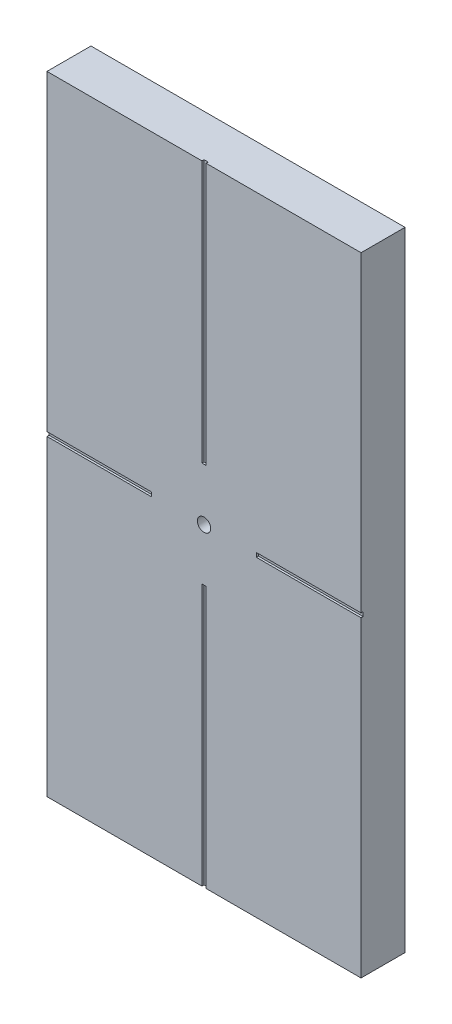
ISO-10303-21;
HEADER;
FILE_DESCRIPTION(('STEP AP214'),'2;1');
FILE_NAME('part.step','',(''),(''),'','','');
FILE_SCHEMA(('AUTOMOTIVE_DESIGN { 1 0 10303 214 1 1 1 1 }'));
ENDSEC;
DATA;
#1=APPLICATION_CONTEXT('core data for automotive mechanical design processes');
#2=APPLICATION_PROTOCOL_DEFINITION('international standard','automotive_design',2000,#1);
#3=PRODUCT_CONTEXT('',#1,'mechanical');
#4=PRODUCT('Part','Part','',(#3));
#5=PRODUCT_RELATED_PRODUCT_CATEGORY('part','',(#4));
#6=PRODUCT_DEFINITION_FORMATION('','',#4);
#7=PRODUCT_DEFINITION_CONTEXT('part definition',#1,'design');
#8=PRODUCT_DEFINITION('design','',#6,#7);
#9=PRODUCT_DEFINITION_SHAPE('','',#8);
#10=(LENGTH_UNIT() NAMED_UNIT(*) SI_UNIT(.MILLI.,.METRE.));
#11=(NAMED_UNIT(*) PLANE_ANGLE_UNIT() SI_UNIT($,.RADIAN.));
#12=(NAMED_UNIT(*) SI_UNIT($,.STERADIAN.) SOLID_ANGLE_UNIT());
#13=UNCERTAINTY_MEASURE_WITH_UNIT(LENGTH_MEASURE(1.E-05),#10,'distance_accuracy_value','');
#14=(GEOMETRIC_REPRESENTATION_CONTEXT(3) GLOBAL_UNCERTAINTY_ASSIGNED_CONTEXT((#13)) GLOBAL_UNIT_ASSIGNED_CONTEXT((#10,
#11,#12)) REPRESENTATION_CONTEXT('',''));
#15=CARTESIAN_POINT('',(0.,0.,0.));
#16=DIRECTION('',(0.,0.,1.));
#17=DIRECTION('',(1.,0.,0.));
#18=AXIS2_PLACEMENT_3D('',#15,#16,#17);
#19=CARTESIAN_POINT('',(0.,0.,8.26141317852243));
#20=DIRECTION('',(0.,0.,-1.));
#21=DIRECTION('',(-1.,0.,0.));
#22=AXIS2_PLACEMENT_3D('',#19,#20,#21);
#23=CYLINDRICAL_SURFACE('',#22,1.5875);
#24=CARTESIAN_POINT('',(0.,0.,-6.325));
#25=DIRECTION('',(0.,0.,-1.));
#26=DIRECTION('',(-1.,0.,0.));
#27=AXIS2_PLACEMENT_3D('',#24,#25,#26);
#28=CIRCLE('',#27,1.5875);
#29=CARTESIAN_POINT('',(-1.5875,0.,-6.325));
#30=VERTEX_POINT('',#29);
#31=EDGE_CURVE('E48',#30,#30,#28,.F.);
#32=CARTESIAN_POINT('',(0.,0.,0.));
#33=DIRECTION('',(0.,0.,1.));
#34=DIRECTION('',(1.,0.,0.));
#35=AXIS2_PLACEMENT_3D('',#32,#33,#34);
#36=CIRCLE('',#35,1.5875);
#37=CARTESIAN_POINT('',(-1.5875,0.,0.));
#38=VERTEX_POINT('',#37);
#39=EDGE_CURVE('E213',#38,#38,#36,.T.);
#40=CARTESIAN_POINT('',(-1.5875,0.,-6.325));
#41=CARTESIAN_POINT('',(-1.5875,0.,-6.25911458333333));
#42=CARTESIAN_POINT('',(-1.5875,0.,-6.19322916666667));
#43=CARTESIAN_POINT('',(-1.5875,0.,-6.06145833333333));
#44=CARTESIAN_POINT('',(-1.5875,0.,-5.99557291666667));
#45=CARTESIAN_POINT('',(-1.5875,0.,-5.86380208333333));
#46=CARTESIAN_POINT('',(-1.5875,0.,-5.79791666666667));
#47=CARTESIAN_POINT('',(-1.5875,0.,-5.66614583333333));
#48=CARTESIAN_POINT('',(-1.5875,0.,-5.60026041666667));
#49=CARTESIAN_POINT('',(-1.5875,0.,-5.46848958333333));
#50=CARTESIAN_POINT('',(-1.5875,0.,-5.40260416666667));
#51=CARTESIAN_POINT('',(-1.5875,0.,-5.27083333333333));
#52=CARTESIAN_POINT('',(-1.5875,0.,-5.20494791666667));
#53=CARTESIAN_POINT('',(-1.5875,0.,-5.07317708333333));
#54=CARTESIAN_POINT('',(-1.5875,0.,-5.00729166666667));
#55=CARTESIAN_POINT('',(-1.5875,0.,-4.87552083333333));
#56=CARTESIAN_POINT('',(-1.5875,0.,-4.80963541666667));
#57=CARTESIAN_POINT('',(-1.5875,0.,-4.67786458333333));
#58=CARTESIAN_POINT('',(-1.5875,0.,-4.61197916666667));
#59=CARTESIAN_POINT('',(-1.5875,0.,-4.48020833333333));
#60=CARTESIAN_POINT('',(-1.5875,0.,-4.41432291666667));
#61=CARTESIAN_POINT('',(-1.5875,0.,-4.28255208333333));
#62=CARTESIAN_POINT('',(-1.5875,0.,-4.21666666666667));
#63=CARTESIAN_POINT('',(-1.5875,0.,-4.08489583333333));
#64=CARTESIAN_POINT('',(-1.5875,0.,-4.01901041666667));
#65=CARTESIAN_POINT('',(-1.5875,0.,-3.88723958333333));
#66=CARTESIAN_POINT('',(-1.5875,0.,-3.82135416666667));
#67=CARTESIAN_POINT('',(-1.5875,0.,-3.68958333333333));
#68=CARTESIAN_POINT('',(-1.5875,0.,-3.62369791666667));
#69=CARTESIAN_POINT('',(-1.5875,0.,-3.49192708333333));
#70=CARTESIAN_POINT('',(-1.5875,0.,-3.42604166666667));
#71=CARTESIAN_POINT('',(-1.5875,0.,-3.29427083333333));
#72=CARTESIAN_POINT('',(-1.5875,0.,-3.22838541666667));
#73=CARTESIAN_POINT('',(-1.5875,0.,-3.09661458333333));
#74=CARTESIAN_POINT('',(-1.5875,0.,-3.03072916666667));
#75=CARTESIAN_POINT('',(-1.5875,0.,-2.89895833333333));
#76=CARTESIAN_POINT('',(-1.5875,0.,-2.83307291666667));
#77=CARTESIAN_POINT('',(-1.5875,0.,-2.70130208333333));
#78=CARTESIAN_POINT('',(-1.5875,0.,-2.63541666666667));
#79=CARTESIAN_POINT('',(-1.5875,0.,-2.50364583333333));
#80=CARTESIAN_POINT('',(-1.5875,0.,-2.43776041666667));
#81=CARTESIAN_POINT('',(-1.5875,0.,-2.30598958333333));
#82=CARTESIAN_POINT('',(-1.5875,0.,-2.24010416666667));
#83=CARTESIAN_POINT('',(-1.5875,0.,-2.10833333333333));
#84=CARTESIAN_POINT('',(-1.5875,0.,-2.04244791666667));
#85=CARTESIAN_POINT('',(-1.5875,0.,-1.91067708333333));
#86=CARTESIAN_POINT('',(-1.5875,0.,-1.84479166666667));
#87=CARTESIAN_POINT('',(-1.5875,0.,-1.71302083333333));
#88=CARTESIAN_POINT('',(-1.5875,0.,-1.64713541666667));
#89=CARTESIAN_POINT('',(-1.5875,0.,-1.51536458333333));
#90=CARTESIAN_POINT('',(-1.5875,0.,-1.44947916666667));
#91=CARTESIAN_POINT('',(-1.5875,0.,-1.31770833333333));
#92=CARTESIAN_POINT('',(-1.5875,0.,-1.25182291666667));
#93=CARTESIAN_POINT('',(-1.5875,0.,-1.12005208333333));
#94=CARTESIAN_POINT('',(-1.5875,0.,-1.05416666666667));
#95=CARTESIAN_POINT('',(-1.5875,0.,-0.922395833333333));
#96=CARTESIAN_POINT('',(-1.5875,0.,-0.856510416666667));
#97=CARTESIAN_POINT('',(-1.5875,0.,-0.724739583333333));
#98=CARTESIAN_POINT('',(-1.5875,0.,-0.658854166666666));
#99=CARTESIAN_POINT('',(-1.5875,0.,-0.527083333333333));
#100=CARTESIAN_POINT('',(-1.5875,0.,-0.461197916666666));
#101=CARTESIAN_POINT('',(-1.5875,0.,-0.329427083333333));
#102=CARTESIAN_POINT('',(-1.5875,0.,-0.263541666666667));
#103=CARTESIAN_POINT('',(-1.5875,0.,-0.131770833333334));
#104=CARTESIAN_POINT('',(-1.5875,0.,-0.065885416666667));
#105=CARTESIAN_POINT('',(-1.5875,0.,0.));
#106=B_SPLINE_CURVE_WITH_KNOTS('',3,(#40,#41,#42,#43,#44,#45,#46,#47,#48,#49,#50,#51,#52,#53,
#54,#55,#56,#57,#58,#59,#60,#61,#62,#63,#64,#65,#66,#67,#68,#69,#70,#71,#72,#73,#74,#75,#76,#77,
#78,#79,#80,#81,#82,#83,#84,#85,#86,#87,#88,#89,#90,#91,#92,#93,#94,#95,#96,#97,#98,#99,#100,
#101,#102,#103,#104,#105),.UNSPECIFIED.,.F.,.F.,(4,2,2,2,2,2,2,2,2,2,2,2,2,2,2,2,2,2,2,2,2,2,2,
2,2,2,2,2,2,2,2,2,4),(0.,0.197656250000001,0.3953125,0.592968750000001,0.790625,0.98828125,
1.1859375,1.38359375,1.58125,1.77890625,1.9765625,2.17421875,2.371875,2.56953125,2.7671875,
2.96484375,3.1625,3.36015625,3.5578125,3.75546875,3.953125,4.15078125,4.3484375,4.54609375,
4.74375,4.94140625,5.1390625,5.33671875,5.534375,5.73203125,5.9296875,6.12734375,6.325),.UNSPECIFIED.);
#107=EDGE_CURVE('BSEAM44',#30,#38,#106,.T.);
#108=ORIENTED_EDGE('',*,*,#31,.F.);
#109=ORIENTED_EDGE('',*,*,#39,.T.);
#110=ORIENTED_EDGE('',*,*,#107,.T.);
#111=ORIENTED_EDGE('',*,*,#107,.F.);
#112=EDGE_LOOP('',(#108,#110,#109,#111));
#113=FACE_BOUND('',#112,.T.);
#114=ADVANCED_FACE('F44',(#113),#23,.F.);
#115=CARTESIAN_POINT('',(0.,0.,-10.5));
#116=DIRECTION('',(0.,0.,1.));
#117=DIRECTION('',(1.,0.,0.));
#118=AXIS2_PLACEMENT_3D('',#115,#116,#117);
#119=PLANE('',#118);
#120=CARTESIAN_POINT('',(0.,0.,-10.5));
#121=DIRECTION('',(0.,0.,-1.));
#122=DIRECTION('',(-1.,0.,0.));
#123=AXIS2_PLACEMENT_3D('',#120,#121,#122);
#124=CIRCLE('',#123,4.);
#125=CARTESIAN_POINT('',(-4.,0.,-10.5));
#126=VERTEX_POINT('',#125);
#127=EDGE_CURVE('E307',#126,#126,#124,.T.);
#128=ORIENTED_EDGE('',*,*,#127,.F.);
#129=EDGE_LOOP('',(#128));
#130=FACE_BOUND('',#129,.T.);
#131=DIRECTION('',(-1.,0.,0.));
#132=VECTOR('',#131,1.);
#133=CARTESIAN_POINT('',(-37.5,-75.,-10.5));
#134=LINE('',#133,#132);
#135=CARTESIAN_POINT('',(37.5,-75.,-10.5));
#136=VERTEX_POINT('',#135);
#137=CARTESIAN_POINT('',(-37.5,-75.,-10.5));
#138=VERTEX_POINT('',#137);
#139=EDGE_CURVE('E53',#136,#138,#134,.T.);
#140=ORIENTED_EDGE('',*,*,#139,.T.);
#141=DIRECTION('',(0.,1.,0.));
#142=VECTOR('',#141,1.);
#143=CARTESIAN_POINT('',(-37.5,-75.,-10.5));
#144=LINE('',#143,#142);
#145=CARTESIAN_POINT('',(-37.5,75.,-10.5));
#146=VERTEX_POINT('',#145);
#147=EDGE_CURVE('E312',#138,#146,#144,.T.);
#148=ORIENTED_EDGE('',*,*,#147,.T.);
#149=DIRECTION('',(1.,0.,0.));
#150=VECTOR('',#149,1.);
#151=CARTESIAN_POINT('',(-37.5,75.,-10.5));
#152=LINE('',#151,#150);
#153=CARTESIAN_POINT('',(37.5,75.,-10.5));
#154=VERTEX_POINT('',#153);
#155=EDGE_CURVE('E310',#146,#154,#152,.T.);
#156=ORIENTED_EDGE('',*,*,#155,.T.);
#157=DIRECTION('',(0.,-1.,0.));
#158=VECTOR('',#157,1.);
#159=CARTESIAN_POINT('',(37.5,-75.,-10.5));
#160=LINE('',#159,#158);
#161=EDGE_CURVE('E11',#154,#136,#160,.T.);
#162=ORIENTED_EDGE('',*,*,#161,.T.);
#163=EDGE_LOOP('',(#140,#148,#156,#162));
#164=FACE_BOUND('',#163,.T.);
#165=ADVANCED_FACE('F368',(#130,#164),#119,.F.);
#166=CARTESIAN_POINT('',(-37.5,-75.,-178.205098312484));
#167=DIRECTION('',(-1.,0.,0.));
#168=DIRECTION('',(0.,-1.,0.));
#169=AXIS2_PLACEMENT_3D('',#166,#167,#168);
#170=PLANE('',#169);
#171=DIRECTION('',(0.,0.,1.));
#172=VECTOR('',#171,1.);
#173=CARTESIAN_POINT('',(-37.5,-0.5,-0.5));
#174=LINE('',#173,#172);
#175=CARTESIAN_POINT('',(-37.5,-0.5,-0.5));
#176=VERTEX_POINT('',#175);
#177=CARTESIAN_POINT('',(-37.5,-0.5,0.));
#178=VERTEX_POINT('',#177);
#179=EDGE_CURVE('E214',#176,#178,#174,.T.);
#180=ORIENTED_EDGE('',*,*,#179,.F.);
#181=DIRECTION('',(0.,-1.,0.));
#182=VECTOR('',#181,1.);
#183=CARTESIAN_POINT('',(-37.5,0.5,-0.5));
#184=LINE('',#183,#182);
#185=CARTESIAN_POINT('',(-37.5,0.5,-0.5));
#186=VERTEX_POINT('',#185);
#187=EDGE_CURVE('E197',#186,#176,#184,.T.);
#188=ORIENTED_EDGE('',*,*,#187,.F.);
#189=DIRECTION('',(0.,0.,1.));
#190=VECTOR('',#189,1.);
#191=CARTESIAN_POINT('',(-37.5,0.5,-0.5));
#192=LINE('',#191,#190);
#193=CARTESIAN_POINT('',(-37.5,0.5,0.));
#194=VERTEX_POINT('',#193);
#195=EDGE_CURVE('E188',#186,#194,#192,.T.);
#196=ORIENTED_EDGE('',*,*,#195,.T.);
#197=DIRECTION('',(0.,-1.,0.));
#198=VECTOR('',#197,1.);
#199=CARTESIAN_POINT('',(-37.5,-75.,0.));
#200=LINE('',#199,#198);
#201=CARTESIAN_POINT('',(-37.5,75.,0.));
#202=VERTEX_POINT('',#201);
#203=EDGE_CURVE('E329',#202,#194,#200,.T.);
#204=ORIENTED_EDGE('',*,*,#203,.F.);
#205=DIRECTION('',(0.,0.,1.));
#206=VECTOR('',#205,1.);
#207=CARTESIAN_POINT('',(-37.5,75.,-178.205098312484));
#208=LINE('',#207,#206);
#209=EDGE_CURVE('E335',#146,#202,#208,.T.);
#210=ORIENTED_EDGE('',*,*,#209,.F.);
#211=ORIENTED_EDGE('',*,*,#147,.F.);
#212=DIRECTION('',(0.,0.,1.));
#213=VECTOR('',#212,1.);
#214=CARTESIAN_POINT('',(-37.5,-75.,-178.205098312484));
#215=LINE('',#214,#213);
#216=CARTESIAN_POINT('',(-37.5,-75.,0.));
#217=VERTEX_POINT('',#216);
#218=EDGE_CURVE('E313',#138,#217,#215,.T.);
#219=ORIENTED_EDGE('',*,*,#218,.T.);
#220=EDGE_CURVE('E328',#178,#217,#200,.T.);
#221=ORIENTED_EDGE('',*,*,#220,.F.);
#222=EDGE_LOOP('',(#180,#188,#196,#204,#210,#211,#219,#221));
#223=FACE_BOUND('',#222,.T.);
#224=ADVANCED_FACE('F388',(#223),#170,.T.);
#225=CARTESIAN_POINT('',(-37.5,75.,-178.205098312484));
#226=DIRECTION('',(0.,1.,0.));
#227=DIRECTION('',(-1.,0.,0.));
#228=AXIS2_PLACEMENT_3D('',#225,#226,#227);
#229=PLANE('',#228);
#230=DIRECTION('',(0.,0.,1.));
#231=VECTOR('',#230,1.);
#232=CARTESIAN_POINT('',(-0.5,75.,-0.5));
#233=LINE('',#232,#231);
#234=CARTESIAN_POINT('',(-0.5,75.,-0.5));
#235=VERTEX_POINT('',#234);
#236=CARTESIAN_POINT('',(-0.5,75.,0.));
#237=VERTEX_POINT('',#236);
#238=EDGE_CURVE('E283',#235,#237,#233,.T.);
#239=ORIENTED_EDGE('',*,*,#238,.F.);
#240=DIRECTION('',(-1.,0.,0.));
#241=VECTOR('',#240,1.);
#242=CARTESIAN_POINT('',(-0.5,75.,-0.5));
#243=LINE('',#242,#241);
#244=CARTESIAN_POINT('',(0.5,75.,-0.5));
#245=VERTEX_POINT('',#244);
#246=EDGE_CURVE('E277',#245,#235,#243,.T.);
#247=ORIENTED_EDGE('',*,*,#246,.F.);
#248=DIRECTION('',(0.,0.,1.));
#249=VECTOR('',#248,1.);
#250=CARTESIAN_POINT('',(0.5,75.,-0.5));
#251=LINE('',#250,#249);
#252=CARTESIAN_POINT('',(0.5,75.,0.));
#253=VERTEX_POINT('',#252);
#254=EDGE_CURVE('E280',#245,#253,#251,.T.);
#255=ORIENTED_EDGE('',*,*,#254,.T.);
#256=DIRECTION('',(-1.,0.,0.));
#257=VECTOR('',#256,1.);
#258=CARTESIAN_POINT('',(-37.5,75.,0.));
#259=LINE('',#258,#257);
#260=CARTESIAN_POINT('',(37.5,75.,0.));
#261=VERTEX_POINT('',#260);
#262=EDGE_CURVE('E325',#261,#253,#259,.T.);
#263=ORIENTED_EDGE('',*,*,#262,.F.);
#264=DIRECTION('',(0.,0.,1.));
#265=VECTOR('',#264,1.);
#266=CARTESIAN_POINT('',(37.5,75.,-178.205098312484));
#267=LINE('',#266,#265);
#268=EDGE_CURVE('E338',#154,#261,#267,.T.);
#269=ORIENTED_EDGE('',*,*,#268,.F.);
#270=ORIENTED_EDGE('',*,*,#155,.F.);
#271=ORIENTED_EDGE('',*,*,#209,.T.);
#272=EDGE_CURVE('E324',#237,#202,#259,.T.);
#273=ORIENTED_EDGE('',*,*,#272,.F.);
#274=EDGE_LOOP('',(#239,#247,#255,#263,#269,#270,#271,#273));
#275=FACE_BOUND('',#274,.T.);
#276=ADVANCED_FACE('F384',(#275),#229,.T.);
#277=CARTESIAN_POINT('',(37.5,-75.,-178.205098312484));
#278=DIRECTION('',(1.,0.,0.));
#279=DIRECTION('',(0.,0.,-1.));
#280=AXIS2_PLACEMENT_3D('',#277,#278,#279);
#281=PLANE('',#280);
#282=DIRECTION('',(0.,0.,1.));
#283=VECTOR('',#282,1.);
#284=CARTESIAN_POINT('',(37.5,0.5,-0.5));
#285=LINE('',#284,#283);
#286=CARTESIAN_POINT('',(37.5,0.5,-0.5));
#287=VERTEX_POINT('',#286);
#288=CARTESIAN_POINT('',(37.5,0.5,0.));
#289=VERTEX_POINT('',#288);
#290=EDGE_CURVE('E225',#287,#289,#285,.T.);
#291=ORIENTED_EDGE('',*,*,#290,.F.);
#292=DIRECTION('',(0.,1.,0.));
#293=VECTOR('',#292,1.);
#294=CARTESIAN_POINT('',(37.5,0.5,-0.5));
#295=LINE('',#294,#293);
#296=CARTESIAN_POINT('',(37.5,-0.5,-0.5));
#297=VERTEX_POINT('',#296);
#298=EDGE_CURVE('E219',#297,#287,#295,.T.);
#299=ORIENTED_EDGE('',*,*,#298,.F.);
#300=DIRECTION('',(0.,0.,1.));
#301=VECTOR('',#300,1.);
#302=CARTESIAN_POINT('',(37.5,-0.5,-0.5));
#303=LINE('',#302,#301);
#304=CARTESIAN_POINT('',(37.5,-0.5,0.));
#305=VERTEX_POINT('',#304);
#306=EDGE_CURVE('E222',#297,#305,#303,.T.);
#307=ORIENTED_EDGE('',*,*,#306,.T.);
#308=DIRECTION('',(0.,1.,0.));
#309=VECTOR('',#308,1.);
#310=CARTESIAN_POINT('',(37.5,-75.,0.));
#311=LINE('',#310,#309);
#312=CARTESIAN_POINT('',(37.5,-75.,0.));
#313=VERTEX_POINT('',#312);
#314=EDGE_CURVE('E321',#313,#305,#311,.T.);
#315=ORIENTED_EDGE('',*,*,#314,.F.);
#316=DIRECTION('',(0.,0.,1.));
#317=VECTOR('',#316,1.);
#318=CARTESIAN_POINT('',(37.5,-75.,-178.205098312484));
#319=LINE('',#318,#317);
#320=EDGE_CURVE('E332',#136,#313,#319,.T.);
#321=ORIENTED_EDGE('',*,*,#320,.F.);
#322=ORIENTED_EDGE('',*,*,#161,.F.);
#323=ORIENTED_EDGE('',*,*,#268,.T.);
#324=EDGE_CURVE('E319',#289,#261,#311,.T.);
#325=ORIENTED_EDGE('',*,*,#324,.F.);
#326=EDGE_LOOP('',(#291,#299,#307,#315,#321,#322,#323,#325));
#327=FACE_BOUND('',#326,.T.);
#328=ADVANCED_FACE('F352',(#327),#281,.T.);
#329=CARTESIAN_POINT('',(-37.5,-75.,-178.205098312484));
#330=DIRECTION('',(0.,-1.,0.));
#331=DIRECTION('',(1.,0.,0.));
#332=AXIS2_PLACEMENT_3D('',#329,#330,#331);
#333=PLANE('',#332);
#334=DIRECTION('',(0.,0.,1.));
#335=VECTOR('',#334,1.);
#336=CARTESIAN_POINT('',(0.5,-75.,-0.5));
#337=LINE('',#336,#335);
#338=CARTESIAN_POINT('',(0.5,-75.,-0.5));
#339=VERTEX_POINT('',#338);
#340=CARTESIAN_POINT('',(0.5,-75.,0.));
#341=VERTEX_POINT('',#340);
#342=EDGE_CURVE('E254',#339,#341,#337,.T.);
#343=ORIENTED_EDGE('',*,*,#342,.F.);
#344=DIRECTION('',(1.,0.,0.));
#345=VECTOR('',#344,1.);
#346=CARTESIAN_POINT('',(-0.5,-75.,-0.5));
#347=LINE('',#346,#345);
#348=CARTESIAN_POINT('',(-0.5,-75.,-0.5));
#349=VERTEX_POINT('',#348);
#350=EDGE_CURVE('E248',#349,#339,#347,.T.);
#351=ORIENTED_EDGE('',*,*,#350,.F.);
#352=DIRECTION('',(0.,0.,1.));
#353=VECTOR('',#352,1.);
#354=CARTESIAN_POINT('',(-0.5,-75.,-0.5));
#355=LINE('',#354,#353);
#356=CARTESIAN_POINT('',(-0.5,-75.,0.));
#357=VERTEX_POINT('',#356);
#358=EDGE_CURVE('E251',#349,#357,#355,.T.);
#359=ORIENTED_EDGE('',*,*,#358,.T.);
#360=DIRECTION('',(1.,0.,0.));
#361=VECTOR('',#360,1.);
#362=CARTESIAN_POINT('',(-37.5,-75.,0.));
#363=LINE('',#362,#361);
#364=EDGE_CURVE('E316',#217,#357,#363,.T.);
#365=ORIENTED_EDGE('',*,*,#364,.F.);
#366=ORIENTED_EDGE('',*,*,#218,.F.);
#367=ORIENTED_EDGE('',*,*,#139,.F.);
#368=ORIENTED_EDGE('',*,*,#320,.T.);
#369=EDGE_CURVE('E320',#341,#313,#363,.T.);
#370=ORIENTED_EDGE('',*,*,#369,.F.);
#371=EDGE_LOOP('',(#343,#351,#359,#365,#366,#367,#368,#370));
#372=FACE_BOUND('',#371,.T.);
#373=ADVANCED_FACE('F347',(#372),#333,.T.);
#374=CARTESIAN_POINT('',(0.,0.,0.));
#375=DIRECTION('',(0.,0.,1.));
#376=DIRECTION('',(1.,0.,0.));
#377=AXIS2_PLACEMENT_3D('',#374,#375,#376);
#378=PLANE('',#377);
#379=DIRECTION('',(1.,0.,0.));
#380=VECTOR('',#379,1.);
#381=CARTESIAN_POINT('',(-12.5,-0.499999999999991,0.));
#382=LINE('',#381,#380);
#383=CARTESIAN_POINT('',(-12.5,-0.499999999999991,0.));
#384=VERTEX_POINT('',#383);
#385=EDGE_CURVE('E201',#178,#384,#382,.T.);
#386=ORIENTED_EDGE('',*,*,#385,.F.);
#387=ORIENTED_EDGE('',*,*,#220,.T.);
#388=ORIENTED_EDGE('',*,*,#364,.T.);
#389=DIRECTION('',(0.,-1.,0.));
#390=VECTOR('',#389,1.);
#391=CARTESIAN_POINT('',(-0.5,-75.,0.));
#392=LINE('',#391,#390);
#393=CARTESIAN_POINT('',(-0.5,-12.5,0.));
#394=VERTEX_POINT('',#393);
#395=EDGE_CURVE('E257',#394,#357,#392,.T.);
#396=ORIENTED_EDGE('',*,*,#395,.F.);
#397=DIRECTION('',(-1.,0.,0.));
#398=VECTOR('',#397,1.);
#399=CARTESIAN_POINT('',(-0.5,-12.5,0.));
#400=LINE('',#399,#398);
#401=CARTESIAN_POINT('',(0.499999999999954,-12.5,0.));
#402=VERTEX_POINT('',#401);
#403=EDGE_CURVE('E259',#402,#394,#400,.T.);
#404=ORIENTED_EDGE('',*,*,#403,.F.);
#405=DIRECTION('',(0.,1.,0.));
#406=VECTOR('',#405,1.);
#407=CARTESIAN_POINT('',(0.499999999999954,-12.5,0.));
#408=LINE('',#407,#406);
#409=EDGE_CURVE('E227',#341,#402,#408,.T.);
#410=ORIENTED_EDGE('',*,*,#409,.F.);
#411=ORIENTED_EDGE('',*,*,#369,.T.);
#412=ORIENTED_EDGE('',*,*,#314,.T.);
#413=DIRECTION('',(1.,0.,0.));
#414=VECTOR('',#413,1.);
#415=CARTESIAN_POINT('',(37.5,-0.5,0.));
#416=LINE('',#415,#414);
#417=CARTESIAN_POINT('',(12.5,-0.499999999999982,0.));
#418=VERTEX_POINT('',#417);
#419=EDGE_CURVE('E228',#418,#305,#416,.T.);
#420=ORIENTED_EDGE('',*,*,#419,.F.);
#421=DIRECTION('',(0.,-1.,0.));
#422=VECTOR('',#421,1.);
#423=CARTESIAN_POINT('',(12.5,0.5,0.));
#424=LINE('',#423,#422);
#425=CARTESIAN_POINT('',(12.5,0.5,0.));
#426=VERTEX_POINT('',#425);
#427=EDGE_CURVE('E230',#426,#418,#424,.T.);
#428=ORIENTED_EDGE('',*,*,#427,.F.);
#429=DIRECTION('',(-1.,0.,0.));
#430=VECTOR('',#429,1.);
#431=CARTESIAN_POINT('',(12.5,0.5,0.));
#432=LINE('',#431,#430);
#433=EDGE_CURVE('E69',#289,#426,#432,.T.);
#434=ORIENTED_EDGE('',*,*,#433,.F.);
#435=ORIENTED_EDGE('',*,*,#324,.T.);
#436=ORIENTED_EDGE('',*,*,#262,.T.);
#437=DIRECTION('',(0.,1.,0.));
#438=VECTOR('',#437,1.);
#439=CARTESIAN_POINT('',(0.5,75.,0.));
#440=LINE('',#439,#438);
#441=CARTESIAN_POINT('',(0.499999999999936,12.5,0.));
#442=VERTEX_POINT('',#441);
#443=EDGE_CURVE('E285',#442,#253,#440,.T.);
#444=ORIENTED_EDGE('',*,*,#443,.F.);
#445=DIRECTION('',(1.,0.,0.));
#446=VECTOR('',#445,1.);
#447=CARTESIAN_POINT('',(-0.5,12.5,0.));
#448=LINE('',#447,#446);
#449=CARTESIAN_POINT('',(-0.5,12.5,0.));
#450=VERTEX_POINT('',#449);
#451=EDGE_CURVE('E287',#450,#442,#448,.T.);
#452=ORIENTED_EDGE('',*,*,#451,.F.);
#453=DIRECTION('',(0.,-1.,0.));
#454=VECTOR('',#453,1.);
#455=CARTESIAN_POINT('',(-0.5,12.5,0.));
#456=LINE('',#455,#454);
#457=EDGE_CURVE('E256',#237,#450,#456,.T.);
#458=ORIENTED_EDGE('',*,*,#457,.F.);
#459=ORIENTED_EDGE('',*,*,#272,.T.);
#460=ORIENTED_EDGE('',*,*,#203,.T.);
#461=DIRECTION('',(-1.,0.,0.));
#462=VECTOR('',#461,1.);
#463=CARTESIAN_POINT('',(-37.5,0.5,0.));
#464=LINE('',#463,#462);
#465=CARTESIAN_POINT('',(-12.5,0.5,0.));
#466=VERTEX_POINT('',#465);
#467=EDGE_CURVE('E204',#466,#194,#464,.T.);
#468=ORIENTED_EDGE('',*,*,#467,.F.);
#469=DIRECTION('',(0.,1.,0.));
#470=VECTOR('',#469,1.);
#471=CARTESIAN_POINT('',(-12.5,0.5,0.));
#472=LINE('',#471,#470);
#473=EDGE_CURVE('E61',#384,#466,#472,.T.);
#474=ORIENTED_EDGE('',*,*,#473,.F.);
#475=EDGE_LOOP('',(#386,#387,#388,#396,#404,#410,#411,#412,#420,#428,#434,#435,#436,#444,#452,
#458,#459,#460,#468,#474));
#476=FACE_BOUND('',#475,.T.);
#477=ORIENTED_EDGE('',*,*,#39,.F.);
#478=EDGE_LOOP('',(#477));
#479=FACE_BOUND('',#478,.T.);
#480=ADVANCED_FACE('F46',(#476,#479),#378,.T.);
#481=CARTESIAN_POINT('',(0.,0.,-6.325));
#482=DIRECTION('',(0.,0.,-1.));
#483=DIRECTION('',(-1.,0.,0.));
#484=AXIS2_PLACEMENT_3D('',#481,#482,#483);
#485=PLANE('',#484);
#486=CARTESIAN_POINT('',(0.,0.,-6.325));
#487=DIRECTION('',(0.,0.,-1.));
#488=DIRECTION('',(-1.,0.,0.));
#489=AXIS2_PLACEMENT_3D('',#486,#487,#488);
#490=CIRCLE('',#489,4.);
#491=CARTESIAN_POINT('',(-4.,0.,-6.325));
#492=VERTEX_POINT('',#491);
#493=EDGE_CURVE('E304',#492,#492,#490,.T.);
#494=ORIENTED_EDGE('',*,*,#493,.T.);
#495=EDGE_LOOP('',(#494));
#496=FACE_BOUND('',#495,.T.);
#497=ORIENTED_EDGE('',*,*,#31,.T.);
#498=EDGE_LOOP('',(#497));
#499=FACE_BOUND('',#498,.T.);
#500=ADVANCED_FACE('F364',(#496,#499),#485,.T.);
#501=CARTESIAN_POINT('',(0.,0.,-10.5));
#502=DIRECTION('',(0.,0.,1.));
#503=DIRECTION('',(1.,0.,0.));
#504=AXIS2_PLACEMENT_3D('',#501,#502,#503);
#505=CYLINDRICAL_SURFACE('',#504,4.);
#506=ORIENTED_EDGE('',*,*,#127,.T.);
#507=EDGE_LOOP('',(#506));
#508=FACE_BOUND('',#507,.T.);
#509=ORIENTED_EDGE('',*,*,#493,.F.);
#510=EDGE_LOOP('',(#509));
#511=FACE_BOUND('',#510,.T.);
#512=ADVANCED_FACE('F377',(#508,#511),#505,.F.);
#513=CARTESIAN_POINT('',(-0.5,12.5,-0.5));
#514=DIRECTION('',(-1.,0.,0.));
#515=DIRECTION('',(0.,-1.,0.));
#516=AXIS2_PLACEMENT_3D('',#513,#514,#515);
#517=PLANE('',#516);
#518=ORIENTED_EDGE('',*,*,#457,.T.);
#519=DIRECTION('',(0.,0.,1.));
#520=VECTOR('',#519,1.);
#521=CARTESIAN_POINT('',(-0.5,12.5,-0.5));
#522=LINE('',#521,#520);
#523=CARTESIAN_POINT('',(-0.5,12.5,-0.5));
#524=VERTEX_POINT('',#523);
#525=EDGE_CURVE('E274',#524,#450,#522,.T.);
#526=ORIENTED_EDGE('',*,*,#525,.F.);
#527=DIRECTION('',(0.,-1.,0.));
#528=VECTOR('',#527,1.);
#529=CARTESIAN_POINT('',(-0.5,12.5,-0.5));
#530=LINE('',#529,#528);
#531=EDGE_CURVE('E288',#235,#524,#530,.T.);
#532=ORIENTED_EDGE('',*,*,#531,.F.);
#533=ORIENTED_EDGE('',*,*,#238,.T.);
#534=EDGE_LOOP('',(#518,#526,#532,#533));
#535=FACE_BOUND('',#534,.T.);
#536=ADVANCED_FACE('F454',(#535),#517,.F.);
#537=CARTESIAN_POINT('',(0.5,75.,-0.5));
#538=DIRECTION('',(1.,0.,0.));
#539=DIRECTION('',(0.,1.,0.));
#540=AXIS2_PLACEMENT_3D('',#537,#538,#539);
#541=PLANE('',#540);
#542=ORIENTED_EDGE('',*,*,#443,.T.);
#543=ORIENTED_EDGE('',*,*,#254,.F.);
#544=DIRECTION('',(0.,1.,0.));
#545=VECTOR('',#544,1.);
#546=CARTESIAN_POINT('',(0.5,75.,-0.5));
#547=LINE('',#546,#545);
#548=CARTESIAN_POINT('',(0.499999999999936,12.5,-0.5));
#549=VERTEX_POINT('',#548);
#550=EDGE_CURVE('E294',#549,#245,#547,.T.);
#551=ORIENTED_EDGE('',*,*,#550,.F.);
#552=DIRECTION('',(0.,0.,1.));
#553=VECTOR('',#552,1.);
#554=CARTESIAN_POINT('',(0.499999999999936,12.5,-0.5));
#555=LINE('',#554,#553);
#556=EDGE_CURVE('E278',#549,#442,#555,.T.);
#557=ORIENTED_EDGE('',*,*,#556,.T.);
#558=EDGE_LOOP('',(#542,#543,#551,#557));
#559=FACE_BOUND('',#558,.T.);
#560=ADVANCED_FACE('F456',(#559),#541,.F.);
#561=CARTESIAN_POINT('',(-0.5,12.5,-0.5));
#562=DIRECTION('',(0.,-1.,0.));
#563=DIRECTION('',(0.,0.,-1.));
#564=AXIS2_PLACEMENT_3D('',#561,#562,#563);
#565=PLANE('',#564);
#566=ORIENTED_EDGE('',*,*,#451,.T.);
#567=ORIENTED_EDGE('',*,*,#556,.F.);
#568=DIRECTION('',(1.,0.,0.));
#569=VECTOR('',#568,1.);
#570=CARTESIAN_POINT('',(-0.5,12.5,-0.5));
#571=LINE('',#570,#569);
#572=EDGE_CURVE('E297',#524,#549,#571,.T.);
#573=ORIENTED_EDGE('',*,*,#572,.F.);
#574=ORIENTED_EDGE('',*,*,#525,.T.);
#575=EDGE_LOOP('',(#566,#567,#573,#574));
#576=FACE_BOUND('',#575,.T.);
#577=ADVANCED_FACE('F458',(#576),#565,.F.);
#578=CARTESIAN_POINT('',(0.,0.,-0.5));
#579=DIRECTION('',(0.,0.,-1.));
#580=DIRECTION('',(-1.,0.,0.));
#581=AXIS2_PLACEMENT_3D('',#578,#579,#580);
#582=PLANE('',#581);
#583=ORIENTED_EDGE('',*,*,#531,.T.);
#584=ORIENTED_EDGE('',*,*,#572,.T.);
#585=ORIENTED_EDGE('',*,*,#550,.T.);
#586=ORIENTED_EDGE('',*,*,#246,.T.);
#587=EDGE_LOOP('',(#583,#584,#585,#586));
#588=FACE_BOUND('',#587,.T.);
#589=ADVANCED_FACE('F442',(#588),#582,.F.);
#590=CARTESIAN_POINT('',(0.499999999999954,-12.5,-0.5));
#591=DIRECTION('',(1.,0.,0.));
#592=DIRECTION('',(0.,1.,0.));
#593=AXIS2_PLACEMENT_3D('',#590,#591,#592);
#594=PLANE('',#593);
#595=ORIENTED_EDGE('',*,*,#409,.T.);
#596=DIRECTION('',(0.,0.,1.));
#597=VECTOR('',#596,1.);
#598=CARTESIAN_POINT('',(0.499999999999954,-12.5,-0.5));
#599=LINE('',#598,#597);
#600=CARTESIAN_POINT('',(0.499999999999954,-12.5,-0.5));
#601=VERTEX_POINT('',#600);
#602=EDGE_CURVE('E245',#601,#402,#599,.T.);
#603=ORIENTED_EDGE('',*,*,#602,.F.);
#604=DIRECTION('',(0.,1.,0.));
#605=VECTOR('',#604,1.);
#606=CARTESIAN_POINT('',(0.499999999999954,-12.5,-0.5));
#607=LINE('',#606,#605);
#608=EDGE_CURVE('E260',#339,#601,#607,.T.);
#609=ORIENTED_EDGE('',*,*,#608,.F.);
#610=ORIENTED_EDGE('',*,*,#342,.T.);
#611=EDGE_LOOP('',(#595,#603,#609,#610));
#612=FACE_BOUND('',#611,.T.);
#613=ADVANCED_FACE('F438',(#612),#594,.F.);
#614=CARTESIAN_POINT('',(-0.5,-75.,-0.5));
#615=DIRECTION('',(-1.,0.,0.));
#616=DIRECTION('',(0.,0.,1.));
#617=AXIS2_PLACEMENT_3D('',#614,#615,#616);
#618=PLANE('',#617);
#619=ORIENTED_EDGE('',*,*,#395,.T.);
#620=ORIENTED_EDGE('',*,*,#358,.F.);
#621=DIRECTION('',(0.,-1.,0.));
#622=VECTOR('',#621,1.);
#623=CARTESIAN_POINT('',(-0.5,-75.,-0.5));
#624=LINE('',#623,#622);
#625=CARTESIAN_POINT('',(-0.5,-12.5,-0.5));
#626=VERTEX_POINT('',#625);
#627=EDGE_CURVE('E266',#626,#349,#624,.T.);
#628=ORIENTED_EDGE('',*,*,#627,.F.);
#629=DIRECTION('',(0.,0.,1.));
#630=VECTOR('',#629,1.);
#631=CARTESIAN_POINT('',(-0.5,-12.5,-0.5));
#632=LINE('',#631,#630);
#633=EDGE_CURVE('E249',#626,#394,#632,.T.);
#634=ORIENTED_EDGE('',*,*,#633,.T.);
#635=EDGE_LOOP('',(#619,#620,#628,#634));
#636=FACE_BOUND('',#635,.T.);
#637=ADVANCED_FACE('F441',(#636),#618,.F.);
#638=CARTESIAN_POINT('',(-0.5,-12.5,-0.5));
#639=DIRECTION('',(0.,1.,0.));
#640=DIRECTION('',(0.,0.,1.));
#641=AXIS2_PLACEMENT_3D('',#638,#639,#640);
#642=PLANE('',#641);
#643=ORIENTED_EDGE('',*,*,#403,.T.);
#644=ORIENTED_EDGE('',*,*,#633,.F.);
#645=DIRECTION('',(-1.,0.,0.));
#646=VECTOR('',#645,1.);
#647=CARTESIAN_POINT('',(-0.5,-12.5,-0.5));
#648=LINE('',#647,#646);
#649=EDGE_CURVE('E269',#601,#626,#648,.T.);
#650=ORIENTED_EDGE('',*,*,#649,.F.);
#651=ORIENTED_EDGE('',*,*,#602,.T.);
#652=EDGE_LOOP('',(#643,#644,#650,#651));
#653=FACE_BOUND('',#652,.T.);
#654=ADVANCED_FACE('F444',(#653),#642,.F.);
#655=CARTESIAN_POINT('',(0.,0.,-0.5));
#656=DIRECTION('',(0.,0.,1.));
#657=DIRECTION('',(1.,0.,0.));
#658=AXIS2_PLACEMENT_3D('',#655,#656,#657);
#659=PLANE('',#658);
#660=ORIENTED_EDGE('',*,*,#608,.T.);
#661=ORIENTED_EDGE('',*,*,#649,.T.);
#662=ORIENTED_EDGE('',*,*,#627,.T.);
#663=ORIENTED_EDGE('',*,*,#350,.T.);
#664=EDGE_LOOP('',(#660,#661,#662,#663));
#665=FACE_BOUND('',#664,.T.);
#666=ADVANCED_FACE('F433',(#665),#659,.T.);
#667=CARTESIAN_POINT('',(12.5,0.5,-0.5));
#668=DIRECTION('',(0.,1.,0.));
#669=DIRECTION('',(0.,0.,1.));
#670=AXIS2_PLACEMENT_3D('',#667,#668,#669);
#671=PLANE('',#670);
#672=ORIENTED_EDGE('',*,*,#433,.T.);
#673=DIRECTION('',(0.,0.,1.));
#674=VECTOR('',#673,1.);
#675=CARTESIAN_POINT('',(12.5,0.5,-0.5));
#676=LINE('',#675,#674);
#677=CARTESIAN_POINT('',(12.5,0.5,-0.5));
#678=VERTEX_POINT('',#677);
#679=EDGE_CURVE('E217',#678,#426,#676,.T.);
#680=ORIENTED_EDGE('',*,*,#679,.F.);
#681=DIRECTION('',(-1.,0.,0.));
#682=VECTOR('',#681,1.);
#683=CARTESIAN_POINT('',(12.5,0.5,-0.5));
#684=LINE('',#683,#682);
#685=EDGE_CURVE('E231',#287,#678,#684,.T.);
#686=ORIENTED_EDGE('',*,*,#685,.F.);
#687=ORIENTED_EDGE('',*,*,#290,.T.);
#688=EDGE_LOOP('',(#672,#680,#686,#687));
#689=FACE_BOUND('',#688,.T.);
#690=ADVANCED_FACE('F421',(#689),#671,.F.);
#691=CARTESIAN_POINT('',(37.5,-0.5,-0.5));
#692=DIRECTION('',(0.,-1.,0.));
#693=DIRECTION('',(1.,0.,0.));
#694=AXIS2_PLACEMENT_3D('',#691,#692,#693);
#695=PLANE('',#694);
#696=ORIENTED_EDGE('',*,*,#419,.T.);
#697=ORIENTED_EDGE('',*,*,#306,.F.);
#698=DIRECTION('',(1.,0.,0.));
#699=VECTOR('',#698,1.);
#700=CARTESIAN_POINT('',(37.5,-0.5,-0.5));
#701=LINE('',#700,#699);
#702=CARTESIAN_POINT('',(12.5,-0.499999999999982,-0.5));
#703=VERTEX_POINT('',#702);
#704=EDGE_CURVE('E237',#703,#297,#701,.T.);
#705=ORIENTED_EDGE('',*,*,#704,.F.);
#706=DIRECTION('',(0.,0.,1.));
#707=VECTOR('',#706,1.);
#708=CARTESIAN_POINT('',(12.5,-0.499999999999982,-0.5));
#709=LINE('',#708,#707);
#710=EDGE_CURVE('E220',#703,#418,#709,.T.);
#711=ORIENTED_EDGE('',*,*,#710,.T.);
#712=EDGE_LOOP('',(#696,#697,#705,#711));
#713=FACE_BOUND('',#712,.T.);
#714=ADVANCED_FACE('F425',(#713),#695,.F.);
#715=CARTESIAN_POINT('',(12.5,0.5,-0.5));
#716=DIRECTION('',(-1.,0.,0.));
#717=DIRECTION('',(0.,0.,1.));
#718=AXIS2_PLACEMENT_3D('',#715,#716,#717);
#719=PLANE('',#718);
#720=ORIENTED_EDGE('',*,*,#427,.T.);
#721=ORIENTED_EDGE('',*,*,#710,.F.);
#722=DIRECTION('',(0.,-1.,0.));
#723=VECTOR('',#722,1.);
#724=CARTESIAN_POINT('',(12.5,0.5,-0.5));
#725=LINE('',#724,#723);
#726=EDGE_CURVE('E240',#678,#703,#725,.T.);
#727=ORIENTED_EDGE('',*,*,#726,.F.);
#728=ORIENTED_EDGE('',*,*,#679,.T.);
#729=EDGE_LOOP('',(#720,#721,#727,#728));
#730=FACE_BOUND('',#729,.T.);
#731=ADVANCED_FACE('F418',(#730),#719,.F.);
#732=CARTESIAN_POINT('',(0.,0.,-0.5));
#733=DIRECTION('',(0.,0.,-1.));
#734=DIRECTION('',(-1.,0.,0.));
#735=AXIS2_PLACEMENT_3D('',#732,#733,#734);
#736=PLANE('',#735);
#737=ORIENTED_EDGE('',*,*,#685,.T.);
#738=ORIENTED_EDGE('',*,*,#726,.T.);
#739=ORIENTED_EDGE('',*,*,#704,.T.);
#740=ORIENTED_EDGE('',*,*,#298,.T.);
#741=EDGE_LOOP('',(#737,#738,#739,#740));
#742=FACE_BOUND('',#741,.T.);
#743=ADVANCED_FACE('F423',(#742),#736,.F.);
#744=CARTESIAN_POINT('',(-12.5,0.5,-0.5));
#745=DIRECTION('',(1.,0.,0.));
#746=DIRECTION('',(0.,0.,-1.));
#747=AXIS2_PLACEMENT_3D('',#744,#745,#746);
#748=PLANE('',#747);
#749=ORIENTED_EDGE('',*,*,#473,.T.);
#750=DIRECTION('',(0.,0.,1.));
#751=VECTOR('',#750,1.);
#752=CARTESIAN_POINT('',(-12.5,0.5,-0.5));
#753=LINE('',#752,#751);
#754=CARTESIAN_POINT('',(-12.5,0.5,-0.5));
#755=VERTEX_POINT('',#754);
#756=EDGE_CURVE('E180',#755,#466,#753,.T.);
#757=ORIENTED_EDGE('',*,*,#756,.F.);
#758=DIRECTION('',(0.,1.,0.));
#759=VECTOR('',#758,1.);
#760=CARTESIAN_POINT('',(-12.5,0.5,-0.5));
#761=LINE('',#760,#759);
#762=CARTESIAN_POINT('',(-12.5,-0.499999999999991,-0.5));
#763=VERTEX_POINT('',#762);
#764=EDGE_CURVE('E184',#763,#755,#761,.T.);
#765=ORIENTED_EDGE('',*,*,#764,.F.);
#766=DIRECTION('',(0.,0.,1.));
#767=VECTOR('',#766,1.);
#768=CARTESIAN_POINT('',(-12.5,-0.499999999999991,-0.5));
#769=LINE('',#768,#767);
#770=EDGE_CURVE('E211',#763,#384,#769,.T.);
#771=ORIENTED_EDGE('',*,*,#770,.T.);
#772=EDGE_LOOP('',(#749,#757,#765,#771));
#773=FACE_BOUND('',#772,.T.);
#774=ADVANCED_FACE('F182',(#773),#748,.F.);
#775=CARTESIAN_POINT('',(-12.5,-0.499999999999991,-0.5));
#776=DIRECTION('',(0.,-1.,0.));
#777=DIRECTION('',(1.,0.,0.));
#778=AXIS2_PLACEMENT_3D('',#775,#776,#777);
#779=PLANE('',#778);
#780=ORIENTED_EDGE('',*,*,#385,.T.);
#781=ORIENTED_EDGE('',*,*,#770,.F.);
#782=DIRECTION('',(1.,0.,0.));
#783=VECTOR('',#782,1.);
#784=CARTESIAN_POINT('',(-12.5,-0.499999999999991,-0.5));
#785=LINE('',#784,#783);
#786=EDGE_CURVE('E189',#176,#763,#785,.T.);
#787=ORIENTED_EDGE('',*,*,#786,.F.);
#788=ORIENTED_EDGE('',*,*,#179,.T.);
#789=EDGE_LOOP('',(#780,#781,#787,#788));
#790=FACE_BOUND('',#789,.T.);
#791=ADVANCED_FACE('F407',(#790),#779,.F.);
#792=CARTESIAN_POINT('',(-37.5,0.5,-0.5));
#793=DIRECTION('',(0.,1.,0.));
#794=DIRECTION('',(0.,0.,1.));
#795=AXIS2_PLACEMENT_3D('',#792,#793,#794);
#796=PLANE('',#795);
#797=ORIENTED_EDGE('',*,*,#467,.T.);
#798=ORIENTED_EDGE('',*,*,#195,.F.);
#799=DIRECTION('',(-1.,0.,0.));
#800=VECTOR('',#799,1.);
#801=CARTESIAN_POINT('',(-37.5,0.5,-0.5));
#802=LINE('',#801,#800);
#803=EDGE_CURVE('E192',#755,#186,#802,.T.);
#804=ORIENTED_EDGE('',*,*,#803,.F.);
#805=ORIENTED_EDGE('',*,*,#756,.T.);
#806=EDGE_LOOP('',(#797,#798,#804,#805));
#807=FACE_BOUND('',#806,.T.);
#808=ADVANCED_FACE('F193',(#807),#796,.F.);
#809=CARTESIAN_POINT('',(0.,0.,-0.5));
#810=DIRECTION('',(0.,0.,-1.));
#811=DIRECTION('',(-1.,0.,0.));
#812=AXIS2_PLACEMENT_3D('',#809,#810,#811);
#813=PLANE('',#812);
#814=ORIENTED_EDGE('',*,*,#764,.T.);
#815=ORIENTED_EDGE('',*,*,#803,.T.);
#816=ORIENTED_EDGE('',*,*,#187,.T.);
#817=ORIENTED_EDGE('',*,*,#786,.T.);
#818=EDGE_LOOP('',(#814,#815,#816,#817));
#819=FACE_BOUND('',#818,.T.);
#820=ADVANCED_FACE('F199',(#819),#813,.F.);
#821=CLOSED_SHELL('',(#114,#165,#224,#276,#328,#373,#480,#500,#512,#536,#560,#577,#589,#613,
#637,#654,#666,#690,#714,#731,#743,#774,#791,#808,#820));
#822=MANIFOLD_SOLID_BREP('B2',#821);
#823=ADVANCED_BREP_SHAPE_REPRESENTATION('',(#18,#822),#14);
#824=SHAPE_DEFINITION_REPRESENTATION(#9,#823);
ENDSEC;
END-ISO-10303-21;
